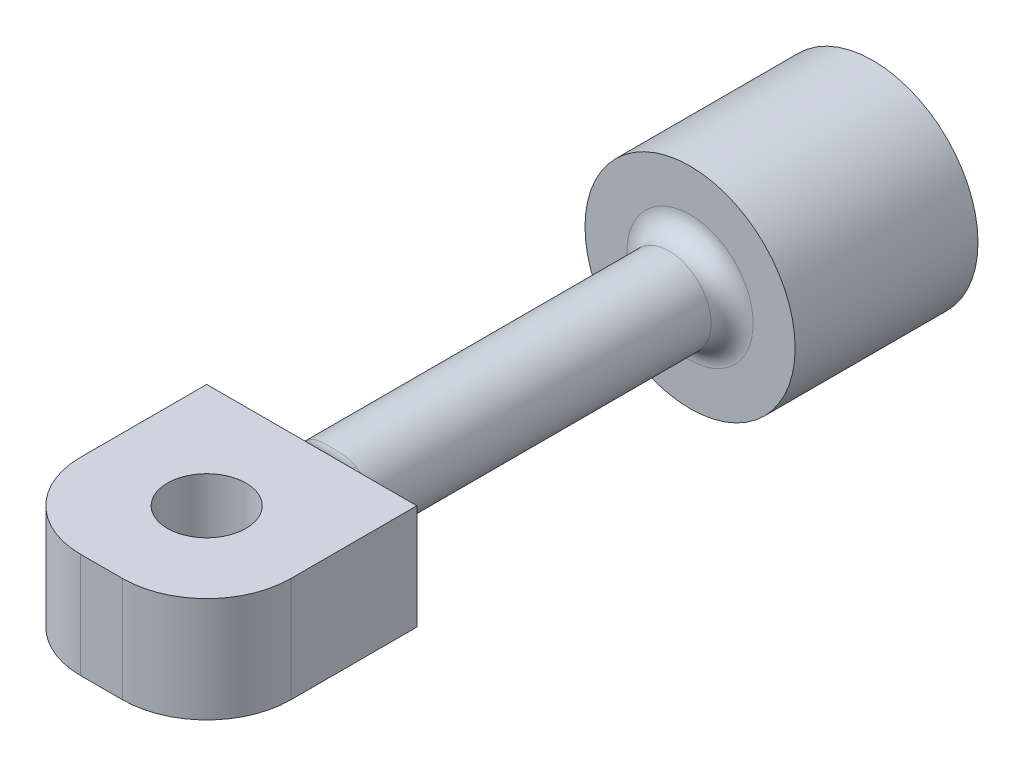
ISO-10303-21;
HEADER;
FILE_DESCRIPTION(('STEP AP214'),'2;1');
FILE_NAME('part.step','',(''),(''),'','','');
FILE_SCHEMA(('AUTOMOTIVE_DESIGN { 1 0 10303 214 1 1 1 1 }'));
ENDSEC;
DATA;
#1=APPLICATION_CONTEXT('core data for automotive mechanical design processes');
#2=APPLICATION_PROTOCOL_DEFINITION('international standard','automotive_design',2000,#1);
#3=PRODUCT_CONTEXT('',#1,'mechanical');
#4=PRODUCT('Part','Part','',(#3));
#5=PRODUCT_RELATED_PRODUCT_CATEGORY('part','',(#4));
#6=PRODUCT_DEFINITION_FORMATION('','',#4);
#7=PRODUCT_DEFINITION_CONTEXT('part definition',#1,'design');
#8=PRODUCT_DEFINITION('design','',#6,#7);
#9=PRODUCT_DEFINITION_SHAPE('','',#8);
#10=(LENGTH_UNIT() NAMED_UNIT(*) SI_UNIT(.MILLI.,.METRE.));
#11=(NAMED_UNIT(*) PLANE_ANGLE_UNIT() SI_UNIT($,.RADIAN.));
#12=(NAMED_UNIT(*) SI_UNIT($,.STERADIAN.) SOLID_ANGLE_UNIT());
#13=UNCERTAINTY_MEASURE_WITH_UNIT(LENGTH_MEASURE(1.E-05),#10,'distance_accuracy_value','');
#14=(GEOMETRIC_REPRESENTATION_CONTEXT(3) GLOBAL_UNCERTAINTY_ASSIGNED_CONTEXT((#13)) GLOBAL_UNIT_ASSIGNED_CONTEXT((#10,
#11,#12)) REPRESENTATION_CONTEXT('',''));
#15=CARTESIAN_POINT('',(0.,0.,0.));
#16=DIRECTION('',(0.,0.,1.));
#17=DIRECTION('',(1.,0.,0.));
#18=AXIS2_PLACEMENT_3D('',#15,#16,#17);
#19=CARTESIAN_POINT('',(0.,0.,33.909));
#20=DIRECTION('',(0.,0.,-1.));
#21=DIRECTION('',(-1.,0.,0.));
#22=AXIS2_PLACEMENT_3D('',#19,#20,#21);
#23=PLANE('',#22);
#24=DIRECTION('',(-1.,0.,0.));
#25=VECTOR('',#24,1.);
#26=CARTESIAN_POINT('',(-6.35,3.175,33.909));
#27=LINE('',#26,#25);
#28=CARTESIAN_POINT('',(-2.10605674187568,3.175,33.909));
#29=VERTEX_POINT('',#28);
#30=CARTESIAN_POINT('',(-6.35,3.175,33.909));
#31=VERTEX_POINT('',#30);
#32=EDGE_CURVE('E139',#29,#31,#27,.T.);
#33=ORIENTED_EDGE('',*,*,#32,.F.);
#34=CARTESIAN_POINT('',(0.,0.,33.909));
#35=DIRECTION('',(0.,0.,-1.));
#36=DIRECTION('',(-1.,0.,0.));
#37=AXIS2_PLACEMENT_3D('',#34,#35,#36);
#38=CIRCLE('',#37,3.81);
#39=CARTESIAN_POINT('',(-2.10605674187568,-3.175,33.909));
#40=VERTEX_POINT('',#39);
#41=EDGE_CURVE('E189',#29,#40,#38,.F.);
#42=ORIENTED_EDGE('',*,*,#41,.T.);
#43=DIRECTION('',(1.,0.,0.));
#44=VECTOR('',#43,1.);
#45=CARTESIAN_POINT('',(-6.35,-3.175,33.909));
#46=LINE('',#45,#44);
#47=CARTESIAN_POINT('',(-6.35,-3.175,33.909));
#48=VERTEX_POINT('',#47);
#49=EDGE_CURVE('E156',#48,#40,#46,.T.);
#50=ORIENTED_EDGE('',*,*,#49,.F.);
#51=DIRECTION('',(0.,-1.,0.));
#52=VECTOR('',#51,1.);
#53=CARTESIAN_POINT('',(-6.35,-3.175,33.909));
#54=LINE('',#53,#52);
#55=EDGE_CURVE('E136',#31,#48,#54,.T.);
#56=ORIENTED_EDGE('',*,*,#55,.F.);
#57=EDGE_LOOP('',(#33,#42,#50,#56));
#58=FACE_BOUND('',#57,.T.);
#59=ADVANCED_FACE('F38',(#58),#23,.T.);
#60=CARTESIAN_POINT('',(0.,0.,11.049));
#61=DIRECTION('',(0.,0.,-1.));
#62=DIRECTION('',(-1.,0.,0.));
#63=AXIS2_PLACEMENT_3D('',#60,#61,#62);
#64=CYLINDRICAL_SURFACE('',#63,6.35);
#65=CARTESIAN_POINT('',(0.,0.,11.049));
#66=DIRECTION('',(0.,0.,1.));
#67=DIRECTION('',(1.,0.,0.));
#68=AXIS2_PLACEMENT_3D('',#65,#66,#67);
#69=CIRCLE('',#68,6.35);
#70=CARTESIAN_POINT('',(6.35,0.,11.049));
#71=VERTEX_POINT('',#70);
#72=EDGE_CURVE('E166',#71,#71,#69,.T.);
#73=ORIENTED_EDGE('',*,*,#72,.F.);
#74=EDGE_LOOP('',(#73));
#75=FACE_BOUND('',#74,.T.);
#76=CARTESIAN_POINT('',(0.,0.,0.));
#77=DIRECTION('',(0.,0.,1.));
#78=DIRECTION('',(1.,0.,0.));
#79=AXIS2_PLACEMENT_3D('',#76,#77,#78);
#80=CIRCLE('',#79,6.35);
#81=CARTESIAN_POINT('',(6.35,0.,0.));
#82=VERTEX_POINT('',#81);
#83=EDGE_CURVE('E127',#82,#82,#80,.T.);
#84=ORIENTED_EDGE('',*,*,#83,.T.);
#85=EDGE_LOOP('',(#84));
#86=FACE_BOUND('',#85,.T.);
#87=ADVANCED_FACE('F283',(#75,#86),#64,.T.);
#88=CARTESIAN_POINT('',(0.,0.,11.049));
#89=DIRECTION('',(0.,0.,1.));
#90=DIRECTION('',(1.,0.,0.));
#91=AXIS2_PLACEMENT_3D('',#88,#89,#90);
#92=PLANE('',#91);
#93=CARTESIAN_POINT('',(0.,0.,11.049));
#94=DIRECTION('',(0.,0.,1.));
#95=DIRECTION('',(1.,0.,0.));
#96=AXIS2_PLACEMENT_3D('',#93,#94,#95);
#97=CIRCLE('',#96,3.81);
#98=CARTESIAN_POINT('',(3.81,0.,11.049));
#99=VERTEX_POINT('',#98);
#100=EDGE_CURVE('E11',#99,#99,#97,.F.);
#101=ORIENTED_EDGE('',*,*,#100,.T.);
#102=EDGE_LOOP('',(#101));
#103=FACE_BOUND('',#102,.T.);
#104=ORIENTED_EDGE('',*,*,#72,.T.);
#105=EDGE_LOOP('',(#104));
#106=FACE_BOUND('',#105,.T.);
#107=ADVANCED_FACE('F288',(#103,#106),#92,.T.);
#108=CARTESIAN_POINT('',(0.,0.,0.));
#109=DIRECTION('',(0.,0.,1.));
#110=DIRECTION('',(1.,0.,0.));
#111=AXIS2_PLACEMENT_3D('',#108,#109,#110);
#112=PLANE('',#111);
#113=ORIENTED_EDGE('',*,*,#83,.F.);
#114=EDGE_LOOP('',(#113));
#115=FACE_BOUND('',#114,.T.);
#116=ADVANCED_FACE('F281',(#115),#112,.F.);
#117=CARTESIAN_POINT('',(0.,0.,33.909));
#118=DIRECTION('',(0.,0.,-1.));
#119=DIRECTION('',(-1.,0.,0.));
#120=AXIS2_PLACEMENT_3D('',#117,#118,#119);
#121=CYLINDRICAL_SURFACE('',#120,2.54);
#122=CARTESIAN_POINT('',(2.75747346033165,3.175,33.909));
#123=CARTESIAN_POINT('',(1.45075360666102,2.15924582636556,34.3925103205279));
#124=CARTESIAN_POINT('',(1.8383156402211,1.75276798433748,32.762287335359));
#125=CARTESIAN_POINT('',(2.72145797705879,3.175,33.909));
#126=CARTESIAN_POINT('',(1.4619449534235,2.1364571380609,34.3627104337745));
#127=CARTESIAN_POINT('',(1.81430531803398,1.77796123271911,32.7443061096109));
#128=CARTESIAN_POINT('',(2.68412922378728,3.175,33.909));
#129=CARTESIAN_POINT('',(1.47073248027829,2.11840312635964,34.3306632550964));
#130=CARTESIAN_POINT('',(1.78941948251894,1.80301384779414,32.7287001018676));
#131=CARTESIAN_POINT('',(2.60721213015224,3.175,33.909));
#132=CARTESIAN_POINT('',(1.48263257214973,2.09138260314045,34.2651764844754));
#133=CARTESIAN_POINT('',(1.73814142009749,1.85249078486686,32.7017579648089));
#134=CARTESIAN_POINT('',(2.56762839040957,3.175,33.909));
#135=CARTESIAN_POINT('',(1.48588018624446,2.08220364788548,34.231802792635));
#136=CARTESIAN_POINT('',(1.71175226027164,1.87691624833565,32.6904134767656));
#137=CARTESIAN_POINT('',(2.44674360913777,3.175,33.909));
#138=CARTESIAN_POINT('',(1.48674334836591,2.06657196841838,34.1346097553019));
#139=CARTESIAN_POINT('',(1.63116240609462,1.94833753668744,32.6621789642376));
#140=CARTESIAN_POINT('',(2.3624790921311,3.175,33.909));
#141=CARTESIAN_POINT('',(1.47653785253469,2.07020606843899,34.0706978369796));
#142=CARTESIAN_POINT('',(1.57498606142162,1.99406237736209,32.6507044916589));
#143=CARTESIAN_POINT('',(2.1410703829851,3.175,33.909));
#144=CARTESIAN_POINT('',(1.42414088680289,2.10221098403041,33.9257559973822));
#145=CARTESIAN_POINT('',(1.42738025532204,2.10395038816791,32.6351701860049));
#146=CARTESIAN_POINT('',(1.99982997151836,3.175,33.909));
#147=CARTESIAN_POINT('',(1.36923366618578,2.14127021575293,33.8496502471815));
#148=CARTESIAN_POINT('',(1.33321998101189,2.16482858767716,32.6384013643611));
#149=CARTESIAN_POINT('',(1.70667074867858,3.175,33.909));
#150=CARTESIAN_POINT('',(1.22391730797736,2.22907432847525,33.7301349698206));
#151=CARTESIAN_POINT('',(1.13778049911941,2.27370249296661,32.6583169592671));
#152=CARTESIAN_POINT('',(1.55468546483664,3.175,33.909));
#153=CARTESIAN_POINT('',(1.13434514523384,2.27783580065136,33.684666092897));
#154=CARTESIAN_POINT('',(1.0364569765578,2.32160717117294,32.6750933064768));
#155=CARTESIAN_POINT('',(1.23295718880419,3.175,33.909));
#156=CARTESIAN_POINT('',(0.926866541861878,2.37010033517938,33.6155588797758));
#157=CARTESIAN_POINT('',(0.821971459202746,2.40625619806118,32.7136356489396));
#158=CARTESIAN_POINT('',(1.06270036998937,3.175,33.909));
#159=CARTESIAN_POINT('',(0.806864110490198,2.41413776676252,33.5919187450191));
#160=CARTESIAN_POINT('',(0.708466913326457,2.44208870148717,32.7356524902216));
#161=CARTESIAN_POINT('',(0.802850613272052,3.175,33.909));
#162=CARTESIAN_POINT('',(0.615600478159448,2.46650168060619,33.5681089924189));
#163=CARTESIAN_POINT('',(0.535233742181263,2.48367535672255,32.7642961639842));
#164=CARTESIAN_POINT('',(0.715600296142354,3.175,33.909));
#165=CARTESIAN_POINT('',(0.550403207057633,2.48168354496009,33.5620685227564));
#166=CARTESIAN_POINT('',(0.477066864094577,2.49550343318059,32.7731056136815));
#167=CARTESIAN_POINT('',(0.539873346842566,3.175,33.909));
#168=CARTESIAN_POINT('',(0.417599545586189,2.50699110839662,33.5527188341097));
#169=CARTESIAN_POINT('',(0.359915564561384,2.51507142565873,32.7882674505011));
#170=CARTESIAN_POINT('',(0.451397155316291,3.175,33.909));
#171=CARTESIAN_POINT('',(0.34977097576357,2.51721062537906,33.5493668970072));
#172=CARTESIAN_POINT('',(0.300931436877421,2.52281277344814,32.7946206979351));
#173=CARTESIAN_POINT('',(0.257633820372502,3.175,33.909));
#174=CARTESIAN_POINT('',(0.20052219015659,2.53350557205262,33.5442223062246));
#175=CARTESIAN_POINT('',(0.171755880248457,2.53515927163514,32.8049249501876));
#176=CARTESIAN_POINT('',(0.152191542896029,3.175,33.909));
#177=CARTESIAN_POINT('',(0.118388680708993,2.53859571542163,33.5427881251985));
#178=CARTESIAN_POINT('',(0.101461028597438,2.53894743153238,32.808236395569));
#179=CARTESIAN_POINT('',(-0.0588439476512452,3.175,33.909));
#180=CARTESIAN_POINT('',(-0.0457236454247866,2.54089515488794,33.5421241175975));
#181=CARTESIAN_POINT('',(-0.0392292984342492,2.54067137423043,32.8097290540229));
#182=CARTESIAN_POINT('',(-0.164437172904387,3.175,33.909));
#183=CARTESIAN_POINT('',(-0.128144441372206,2.53811621016374,33.5428909457727));
#184=CARTESIAN_POINT('',(-0.109624781936479,2.53860665450393,32.8079098265766));
#185=CARTESIAN_POINT('',(-0.375134437884289,3.175,33.909));
#186=CARTESIAN_POINT('',(-0.291191200794401,2.52489593997202,33.5469030657575));
#187=CARTESIAN_POINT('',(-0.250089625255972,2.52864167150419,32.7994527065369));
#188=CARTESIAN_POINT('',(-0.480235902219539,3.175,33.909));
#189=CARTESIAN_POINT('',(-0.372241171557344,2.51435942355359,33.5501784384892));
#190=CARTESIAN_POINT('',(-0.320157268145559,2.52072311386589,32.7927997086069));
#191=CARTESIAN_POINT('',(-0.688772361635576,3.175,33.909));
#192=CARTESIAN_POINT('',(-0.530475009564656,2.48633248453244,33.5602337205924));
#193=CARTESIAN_POINT('',(-0.459181574423796,2.49914052659052,32.7758264506634));
#194=CARTESIAN_POINT('',(-0.792207253663055,3.175,33.909));
#195=CARTESIAN_POINT('',(-0.608039298474719,2.468697060834,33.5670759119238));
#196=CARTESIAN_POINT('',(-0.528138169110239,2.48547614306246,32.7655059647719));
#197=CARTESIAN_POINT('',(-1.08102047728346,3.175,33.909));
#198=CARTESIAN_POINT('',(-0.820428628133336,2.41018525109081,33.5937840228559));
#199=CARTESIAN_POINT('',(-0.720680318186171,2.43897203089037,32.7335645468445));
#200=CARTESIAN_POINT('',(-1.26383869884293,3.175,33.909));
#201=CARTESIAN_POINT('',(-0.948845354349257,2.36181615097928,33.6200650298272));
#202=CARTESIAN_POINT('',(-0.842559132546411,2.39960403191938,32.7096298567921));
#203=CARTESIAN_POINT('',(-1.61836923396855,3.175,33.909));
#204=CARTESIAN_POINT('',(-1.17397398571186,2.25823492815116,33.7015655950387));
#205=CARTESIAN_POINT('',(-1.07891282266116,2.3029852734753,32.6678481808692));
#206=CARTESIAN_POINT('',(-1.79013250310725,3.175,33.909));
#207=CARTESIAN_POINT('',(-1.27118984233523,2.20186556768394,33.7587127825564));
#208=CARTESIAN_POINT('',(-1.19342166879709,2.24582490508662,32.6499713570588));
#209=CARTESIAN_POINT('',(-2.0566142211182,3.175,33.909));
#210=CARTESIAN_POINT('',(-1.38914589027986,2.12717702306518,33.8803251554777));
#211=CARTESIAN_POINT('',(-1.37107614737573,2.13962315517979,32.6380108959743));
#212=CARTESIAN_POINT('',(-2.15568332115343,3.175,33.909));
#213=CARTESIAN_POINT('',(-1.42513559033852,2.10219868982999,33.9356213641979));
#214=CARTESIAN_POINT('',(-1.43712221399043,2.09583194074454,32.6374439142818));
#215=CARTESIAN_POINT('',(-2.29937534719872,3.175,33.909));
#216=CARTESIAN_POINT('',(-1.46182244061619,2.07900024101459,34.0274930819406));
#217=CARTESIAN_POINT('',(-1.53291689806266,2.02567263231361,32.6458611282743));
#218=CARTESIAN_POINT('',(-2.34662112284787,3.175,33.909));
#219=CARTESIAN_POINT('',(-1.47119060673998,2.07367961547336,34.0604137288786));
#220=CARTESIAN_POINT('',(-1.56441408186909,2.00144186745873,32.6502454036791));
#221=CARTESIAN_POINT('',(-2.43913130996258,3.175,33.909));
#222=CARTESIAN_POINT('',(-1.48366955631215,2.06969009583306,34.1286792504366));
#223=CARTESIAN_POINT('',(-1.62608753999992,1.95167075755933,32.6627751978397));
#224=CARTESIAN_POINT('',(-2.48439247491016,3.175,33.909));
#225=CARTESIAN_POINT('',(-1.48661398449224,2.07119839725305,34.1640913822208));
#226=CARTESIAN_POINT('',(-1.65626164997896,1.92612840501469,32.6709266449294));
#227=CARTESIAN_POINT('',(-2.52848744698442,3.175,33.909));
#228=CARTESIAN_POINT('',(-1.48616480332682,2.07702560245629,34.1995970549083));
#229=CARTESIAN_POINT('',(-1.68565829798961,1.90004107913981,32.6812724046579));
#230=(BOUNDED_SURFACE() B_SPLINE_SURFACE(3,2,((#122,#123,#124),(#125,#126,#127),(#128,#129,
#130),(#131,#132,#133),(#134,#135,#136),(#137,#138,#139),(#140,#141,#142),(#143,#144,#145),
(#146,#147,#148),(#149,#150,#151),(#152,#153,#154),(#155,#156,#157),(#158,#159,#160),(#161,#162,
#163),(#164,#165,#166),(#167,#168,#169),(#170,#171,#172),(#173,#174,#175),(#176,#177,#178),
(#179,#180,#181),(#182,#183,#184),(#185,#186,#187),(#188,#189,#190),(#191,#192,#193),(#194,#195,
#196),(#197,#198,#199),(#200,#201,#202),(#203,#204,#205),(#206,#207,#208),(#209,#210,#211),
(#212,#213,#214),(#215,#216,#217),(#218,#219,#220),(#221,#222,#223),(#224,#225,#226),(#227,#228,
#229)),.UNSPECIFIED.,.F.,.F.,.F.) B_SPLINE_SURFACE_WITH_KNOTS((4,2,2,2,2,2,2,2,2,2,2,2,2,2,2,2,
2,4),(3,3),(0.,0.165478964280865,0.330631634870746,0.657187123329499,1.15911064900215,
1.66446964051091,2.20221153747686,2.47042166305056,2.73853775979549,3.05498965599523,
3.37146872352753,3.68894105243304,4.00643293763199,4.58500515335889,5.16068472701099,
5.51628394310174,5.69542592105601,5.87485077670779),(0.,1.),
.UNSPECIFIED.) GEOMETRIC_REPRESENTATION_ITEM() RATIONAL_B_SPLINE_SURFACE(((1.,0.593046572981363,
1.),(1.,0.599903529057048,1.),(1.,0.606980350720252,1.),(1.,0.621392399509858,1.),(1.,
0.628727089593793,1.),(1.,0.650721583165667,1.),(1.,0.665534782996795,1.),(1.,0.702309478093336,
1.),(1.,0.723837732724251,1.),(1.,0.763359635592699,1.),(1.,0.781328082295264,1.),(1.,
0.81353929178972,1.),(1.,0.827469535836317,1.),(1.,0.84375223507824,1.),(1.,0.848408111753961,
1.),(1.,0.856131724328274,1.),(1.,0.859200016423386,1.),(1.,0.864098930789858,1.),(1.,
0.865606705247396,1.),(1.,0.866292473729694,1.),(1.,0.865470267702701,1.),(1.,0.861511666313443,
1.),(1.,0.858368016026511,1.),(1.,0.849840328339414,1.),(1.,0.844456152943346,1.),(1.,
0.826251623547143,1.),(1.,0.810957187187147,1.),(1.,0.774307157851412,1.),(1.,0.752982250667473,
1.),(1.,0.715018996161015,1.),(1.,0.699705643124637,1.),(1.,0.676076182482073,1.),(1.,
0.668058615733603,1.),(1.,0.651959945216799,1.),(1.,0.643878761110568,1.),(1.,0.635848556141678,1.))) REPRESENTATION_ITEM('') SURFACE());
#231=CARTESIAN_POINT('',(-1.68565829798961,1.90004107913981,32.6812724046579));
#232=CARTESIAN_POINT('',(-1.65626164997896,1.92612840501469,32.6709266449294));
#233=CARTESIAN_POINT('',(-1.62608753999992,1.95167075755933,32.6627751978397));
#234=CARTESIAN_POINT('',(-1.56441408186909,2.00144186745873,32.6502454036791));
#235=CARTESIAN_POINT('',(-1.53291689806266,2.02567263231361,32.6458611282743));
#236=CARTESIAN_POINT('',(-1.43712221399043,2.09583194074454,32.6374439142818));
#237=CARTESIAN_POINT('',(-1.37107614737573,2.13962315517979,32.6380108959743));
#238=CARTESIAN_POINT('',(-1.19342166879709,2.24582490508662,32.6499713570588));
#239=CARTESIAN_POINT('',(-1.07891282266116,2.3029852734753,32.6678481808692));
#240=CARTESIAN_POINT('',(-0.842559132546411,2.39960403191938,32.7096298567921));
#241=CARTESIAN_POINT('',(-0.720680318186171,2.43897203089037,32.7335645468445));
#242=CARTESIAN_POINT('',(-0.528138169110239,2.48547614306246,32.7655059647719));
#243=CARTESIAN_POINT('',(-0.459181574423796,2.49914052659052,32.7758264506634));
#244=CARTESIAN_POINT('',(-0.320157268145559,2.52072311386589,32.7927997086069));
#245=CARTESIAN_POINT('',(-0.250089625255972,2.52864167150419,32.7994527065369));
#246=CARTESIAN_POINT('',(-0.109624781936479,2.53860665450393,32.8079098265766));
#247=CARTESIAN_POINT('',(-0.0392292984342491,2.54067137423043,32.8097290540229));
#248=CARTESIAN_POINT('',(0.101461028597438,2.53894743153238,32.808236395569));
#249=CARTESIAN_POINT('',(0.171755880248457,2.53515927163514,32.8049249501876));
#250=CARTESIAN_POINT('',(0.300931436877421,2.52281277344814,32.7946206979351));
#251=CARTESIAN_POINT('',(0.359915564561384,2.51507142565873,32.7882674505011));
#252=CARTESIAN_POINT('',(0.477066864094577,2.49550343318059,32.7731056136815));
#253=CARTESIAN_POINT('',(0.535233742181263,2.48367535672255,32.7642961639842));
#254=CARTESIAN_POINT('',(0.708466913326457,2.44208870148717,32.7356524902216));
#255=CARTESIAN_POINT('',(0.821971459202746,2.40625619806118,32.7136356489396));
#256=CARTESIAN_POINT('',(1.0364569765578,2.32160717117294,32.6750933064768));
#257=CARTESIAN_POINT('',(1.13778049911941,2.27370249296661,32.6583169592671));
#258=CARTESIAN_POINT('',(1.33321998101189,2.16482858767716,32.6384013643611));
#259=CARTESIAN_POINT('',(1.42738025532204,2.10395038816791,32.6351701860049));
#260=CARTESIAN_POINT('',(1.57498606142162,1.99406237736209,32.6507044916589));
#261=CARTESIAN_POINT('',(1.63116240609462,1.94833753668744,32.6621789642376));
#262=CARTESIAN_POINT('',(1.71175226027164,1.87691624833565,32.6904134767656));
#263=CARTESIAN_POINT('',(1.73814142009749,1.85249078486686,32.7017579648089));
#264=CARTESIAN_POINT('',(1.78941948251894,1.80301384779414,32.7287001018676));
#265=CARTESIAN_POINT('',(1.81430531803398,1.7779612327191,32.7443061096109));
#266=CARTESIAN_POINT('',(1.8383156402211,1.75276798433748,32.762287335359));
#267=B_SPLINE_CURVE_WITH_KNOTS('',3,(#231,#232,#233,#234,#235,#236,#237,#238,#239,#240,#241,
#242,#243,#244,#245,#246,#247,#248,#249,#250,#251,#252,#253,#254,#255,#256,#257,#258,#259,#260,
#261,#262,#263,#264,#265,#266),.UNSPECIFIED.,.F.,.F.,(4,2,2,2,2,2,2,2,2,2,2,2,2,2,2,2,2,4),(0.,
0.17942485565178,0.358566833606047,0.714166049696798,1.2898456233489,1.86841783907579,
2.18590972427475,2.50338205318026,2.81986112071256,3.13631301691229,3.40442911365723,
3.67263923923093,4.21038113619688,4.71574012770563,5.21766365337829,5.54421914183704,
5.70937181242692,5.87485077670779),.UNSPECIFIED.);
#268=CARTESIAN_POINT('',(-1.40403782791712,2.11666666666667,32.639));
#269=VERTEX_POINT('',#268);
#270=CARTESIAN_POINT('',(1.40403782791712,2.11666666666667,32.639));
#271=VERTEX_POINT('',#270);
#272=EDGE_CURVE('E194',#269,#271,#267,.T.);
#273=ORIENTED_EDGE('',*,*,#272,.T.);
#274=CARTESIAN_POINT('',(0.,0.,32.639));
#275=DIRECTION('',(0.,0.,-1.));
#276=DIRECTION('',(-1.,0.,0.));
#277=AXIS2_PLACEMENT_3D('',#274,#275,#276);
#278=CIRCLE('',#277,2.54);
#279=CARTESIAN_POINT('',(1.40403782791712,-2.11666666666667,32.639));
#280=VERTEX_POINT('',#279);
#281=EDGE_CURVE('E47',#271,#280,#278,.T.);
#282=ORIENTED_EDGE('',*,*,#281,.T.);
#283=CARTESIAN_POINT('',(-2.75747346033165,-3.175,33.909));
#284=CARTESIAN_POINT('',(-1.45075360666102,-2.15924582636556,34.3925103205279));
#285=CARTESIAN_POINT('',(-1.8383156402211,-1.75276798433748,32.762287335359));
#286=CARTESIAN_POINT('',(-2.72145797705879,-3.175,33.909));
#287=CARTESIAN_POINT('',(-1.4619449534235,-2.1364571380609,34.3627104337745));
#288=CARTESIAN_POINT('',(-1.81430531803398,-1.77796123271911,32.7443061096109));
#289=CARTESIAN_POINT('',(-2.68412922378728,-3.175,33.909));
#290=CARTESIAN_POINT('',(-1.47073248027829,-2.11840312635964,34.3306632550964));
#291=CARTESIAN_POINT('',(-1.78941948251894,-1.80301384779414,32.7287001018676));
#292=CARTESIAN_POINT('',(-2.60721213015224,-3.175,33.909));
#293=CARTESIAN_POINT('',(-1.48263257214973,-2.09138260314045,34.2651764844754));
#294=CARTESIAN_POINT('',(-1.73814142009749,-1.85249078486686,32.7017579648089));
#295=CARTESIAN_POINT('',(-2.56762839040957,-3.175,33.909));
#296=CARTESIAN_POINT('',(-1.48588018624446,-2.08220364788548,34.231802792635));
#297=CARTESIAN_POINT('',(-1.71175226027164,-1.87691624833565,32.6904134767656));
#298=CARTESIAN_POINT('',(-2.44674360913777,-3.175,33.909));
#299=CARTESIAN_POINT('',(-1.48674334836591,-2.06657196841838,34.1346097553019));
#300=CARTESIAN_POINT('',(-1.63116240609462,-1.94833753668744,32.6621789642376));
#301=CARTESIAN_POINT('',(-2.3624790921311,-3.175,33.909));
#302=CARTESIAN_POINT('',(-1.47653785253469,-2.07020606843899,34.0706978369796));
#303=CARTESIAN_POINT('',(-1.57498606142162,-1.99406237736209,32.6507044916589));
#304=CARTESIAN_POINT('',(-2.1410703829851,-3.175,33.909));
#305=CARTESIAN_POINT('',(-1.42414088680289,-2.10221098403041,33.9257559973822));
#306=CARTESIAN_POINT('',(-1.42738025532204,-2.10395038816791,32.6351701860049));
#307=CARTESIAN_POINT('',(-1.99982997151836,-3.175,33.909));
#308=CARTESIAN_POINT('',(-1.36923366618578,-2.14127021575293,33.8496502471815));
#309=CARTESIAN_POINT('',(-1.33321998101189,-2.16482858767716,32.6384013643611));
#310=CARTESIAN_POINT('',(-1.70667074867858,-3.175,33.909));
#311=CARTESIAN_POINT('',(-1.22391730797736,-2.22907432847525,33.7301349698206));
#312=CARTESIAN_POINT('',(-1.13778049911941,-2.27370249296661,32.6583169592671));
#313=CARTESIAN_POINT('',(-1.55468546483664,-3.175,33.909));
#314=CARTESIAN_POINT('',(-1.13434514523384,-2.27783580065136,33.684666092897));
#315=CARTESIAN_POINT('',(-1.0364569765578,-2.32160717117294,32.6750933064768));
#316=CARTESIAN_POINT('',(-1.23295718880419,-3.175,33.909));
#317=CARTESIAN_POINT('',(-0.926866541861878,-2.37010033517938,33.6155588797758));
#318=CARTESIAN_POINT('',(-0.821971459202746,-2.40625619806118,32.7136356489396));
#319=CARTESIAN_POINT('',(-1.06270036998937,-3.175,33.909));
#320=CARTESIAN_POINT('',(-0.806864110490198,-2.41413776676252,33.5919187450191));
#321=CARTESIAN_POINT('',(-0.708466913326457,-2.44208870148717,32.7356524902216));
#322=CARTESIAN_POINT('',(-0.802850613272052,-3.175,33.909));
#323=CARTESIAN_POINT('',(-0.615600478159448,-2.46650168060619,33.5681089924189));
#324=CARTESIAN_POINT('',(-0.535233742181263,-2.48367535672255,32.7642961639842));
#325=CARTESIAN_POINT('',(-0.715600296142354,-3.175,33.909));
#326=CARTESIAN_POINT('',(-0.550403207057633,-2.48168354496009,33.5620685227564));
#327=CARTESIAN_POINT('',(-0.477066864094577,-2.49550343318059,32.7731056136815));
#328=CARTESIAN_POINT('',(-0.539873346842566,-3.175,33.909));
#329=CARTESIAN_POINT('',(-0.417599545586189,-2.50699110839662,33.5527188341097));
#330=CARTESIAN_POINT('',(-0.359915564561384,-2.51507142565873,32.7882674505011));
#331=CARTESIAN_POINT('',(-0.451397155316291,-3.175,33.909));
#332=CARTESIAN_POINT('',(-0.34977097576357,-2.51721062537906,33.5493668970072));
#333=CARTESIAN_POINT('',(-0.300931436877421,-2.52281277344814,32.7946206979351));
#334=CARTESIAN_POINT('',(-0.257633820372502,-3.175,33.909));
#335=CARTESIAN_POINT('',(-0.20052219015659,-2.53350557205262,33.5442223062246));
#336=CARTESIAN_POINT('',(-0.171755880248457,-2.53515927163514,32.8049249501876));
#337=CARTESIAN_POINT('',(-0.152191542896029,-3.175,33.909));
#338=CARTESIAN_POINT('',(-0.118388680708993,-2.53859571542163,33.5427881251985));
#339=CARTESIAN_POINT('',(-0.101461028597438,-2.53894743153238,32.808236395569));
#340=CARTESIAN_POINT('',(0.0588439476512452,-3.175,33.909));
#341=CARTESIAN_POINT('',(0.0457236454247866,-2.54089515488794,33.5421241175975));
#342=CARTESIAN_POINT('',(0.0392292984342492,-2.54067137423043,32.8097290540229));
#343=CARTESIAN_POINT('',(0.164437172904387,-3.175,33.909));
#344=CARTESIAN_POINT('',(0.128144441372206,-2.53811621016374,33.5428909457727));
#345=CARTESIAN_POINT('',(0.109624781936479,-2.53860665450393,32.8079098265766));
#346=CARTESIAN_POINT('',(0.375134437884289,-3.175,33.909));
#347=CARTESIAN_POINT('',(0.291191200794401,-2.52489593997202,33.5469030657575));
#348=CARTESIAN_POINT('',(0.250089625255972,-2.52864167150419,32.7994527065369));
#349=CARTESIAN_POINT('',(0.480235902219539,-3.175,33.909));
#350=CARTESIAN_POINT('',(0.372241171557344,-2.51435942355359,33.5501784384892));
#351=CARTESIAN_POINT('',(0.320157268145559,-2.52072311386589,32.7927997086069));
#352=CARTESIAN_POINT('',(0.688772361635576,-3.175,33.909));
#353=CARTESIAN_POINT('',(0.530475009564656,-2.48633248453244,33.5602337205924));
#354=CARTESIAN_POINT('',(0.459181574423796,-2.49914052659052,32.7758264506634));
#355=CARTESIAN_POINT('',(0.792207253663055,-3.175,33.909));
#356=CARTESIAN_POINT('',(0.608039298474719,-2.468697060834,33.5670759119238));
#357=CARTESIAN_POINT('',(0.528138169110239,-2.48547614306246,32.7655059647719));
#358=CARTESIAN_POINT('',(1.08102047728346,-3.175,33.909));
#359=CARTESIAN_POINT('',(0.820428628133336,-2.41018525109081,33.5937840228559));
#360=CARTESIAN_POINT('',(0.720680318186171,-2.43897203089037,32.7335645468445));
#361=CARTESIAN_POINT('',(1.26383869884293,-3.175,33.909));
#362=CARTESIAN_POINT('',(0.948845354349257,-2.36181615097928,33.6200650298272));
#363=CARTESIAN_POINT('',(0.842559132546411,-2.39960403191938,32.7096298567921));
#364=CARTESIAN_POINT('',(1.61836923396855,-3.175,33.909));
#365=CARTESIAN_POINT('',(1.17397398571186,-2.25823492815116,33.7015655950387));
#366=CARTESIAN_POINT('',(1.07891282266116,-2.3029852734753,32.6678481808692));
#367=CARTESIAN_POINT('',(1.79013250310725,-3.175,33.909));
#368=CARTESIAN_POINT('',(1.27118984233523,-2.20186556768394,33.7587127825564));
#369=CARTESIAN_POINT('',(1.19342166879709,-2.24582490508662,32.6499713570588));
#370=CARTESIAN_POINT('',(2.0566142211182,-3.175,33.909));
#371=CARTESIAN_POINT('',(1.38914589027986,-2.12717702306518,33.8803251554777));
#372=CARTESIAN_POINT('',(1.37107614737573,-2.13962315517979,32.6380108959743));
#373=CARTESIAN_POINT('',(2.15568332115343,-3.175,33.909));
#374=CARTESIAN_POINT('',(1.42513559033852,-2.10219868982999,33.9356213641979));
#375=CARTESIAN_POINT('',(1.43712221399043,-2.09583194074454,32.6374439142818));
#376=CARTESIAN_POINT('',(2.29937534719872,-3.175,33.909));
#377=CARTESIAN_POINT('',(1.46182244061619,-2.07900024101459,34.0274930819406));
#378=CARTESIAN_POINT('',(1.53291689806266,-2.02567263231361,32.6458611282743));
#379=CARTESIAN_POINT('',(2.34662112284787,-3.175,33.909));
#380=CARTESIAN_POINT('',(1.47119060673998,-2.07367961547336,34.0604137288786));
#381=CARTESIAN_POINT('',(1.56441408186909,-2.00144186745873,32.6502454036791));
#382=CARTESIAN_POINT('',(2.43913130996258,-3.175,33.909));
#383=CARTESIAN_POINT('',(1.48366955631215,-2.06969009583306,34.1286792504366));
#384=CARTESIAN_POINT('',(1.62608753999992,-1.95167075755933,32.6627751978397));
#385=CARTESIAN_POINT('',(2.48439247491016,-3.175,33.909));
#386=CARTESIAN_POINT('',(1.48661398449224,-2.07119839725305,34.1640913822208));
#387=CARTESIAN_POINT('',(1.65626164997896,-1.92612840501469,32.6709266449294));
#388=CARTESIAN_POINT('',(2.52848744698442,-3.175,33.909));
#389=CARTESIAN_POINT('',(1.48616480332682,-2.07702560245629,34.1995970549083));
#390=CARTESIAN_POINT('',(1.68565829798961,-1.90004107913981,32.6812724046579));
#391=(BOUNDED_SURFACE() B_SPLINE_SURFACE(3,2,((#283,#284,#285),(#286,#287,#288),(#289,#290,
#291),(#292,#293,#294),(#295,#296,#297),(#298,#299,#300),(#301,#302,#303),(#304,#305,#306),
(#307,#308,#309),(#310,#311,#312),(#313,#314,#315),(#316,#317,#318),(#319,#320,#321),(#322,#323,
#324),(#325,#326,#327),(#328,#329,#330),(#331,#332,#333),(#334,#335,#336),(#337,#338,#339),
(#340,#341,#342),(#343,#344,#345),(#346,#347,#348),(#349,#350,#351),(#352,#353,#354),(#355,#356,
#357),(#358,#359,#360),(#361,#362,#363),(#364,#365,#366),(#367,#368,#369),(#370,#371,#372),
(#373,#374,#375),(#376,#377,#378),(#379,#380,#381),(#382,#383,#384),(#385,#386,#387),(#388,#389,
#390)),.UNSPECIFIED.,.F.,.F.,.F.) B_SPLINE_SURFACE_WITH_KNOTS((4,2,2,2,2,2,2,2,2,2,2,2,2,2,2,2,
2,4),(3,3),(0.,0.165478964280865,0.330631634870746,0.657187123329499,1.15911064900215,
1.66446964051091,2.20221153747686,2.47042166305056,2.73853775979549,3.05498965599523,
3.37146872352753,3.68894105243304,4.00643293763199,4.58500515335889,5.16068472701099,
5.51628394310174,5.69542592105601,5.87485077670779),(0.,1.),
.UNSPECIFIED.) GEOMETRIC_REPRESENTATION_ITEM() RATIONAL_B_SPLINE_SURFACE(((1.,0.593046572981363,
1.),(1.,0.599903529057048,1.),(1.,0.606980350720252,1.),(1.,0.621392399509858,1.),(1.,
0.628727089593793,1.),(1.,0.650721583165667,1.),(1.,0.665534782996795,1.),(1.,0.702309478093336,
1.),(1.,0.723837732724251,1.),(1.,0.763359635592699,1.),(1.,0.781328082295264,1.),(1.,
0.81353929178972,1.),(1.,0.827469535836317,1.),(1.,0.84375223507824,1.),(1.,0.848408111753961,
1.),(1.,0.856131724328274,1.),(1.,0.859200016423386,1.),(1.,0.864098930789858,1.),(1.,
0.865606705247396,1.),(1.,0.866292473729694,1.),(1.,0.865470267702701,1.),(1.,0.861511666313443,
1.),(1.,0.858368016026511,1.),(1.,0.849840328339414,1.),(1.,0.844456152943346,1.),(1.,
0.826251623547143,1.),(1.,0.810957187187147,1.),(1.,0.774307157851412,1.),(1.,0.752982250667473,
1.),(1.,0.715018996161015,1.),(1.,0.699705643124637,1.),(1.,0.676076182482073,1.),(1.,
0.668058615733603,1.),(1.,0.651959945216799,1.),(1.,0.643878761110568,1.),(1.,0.635848556141678,1.))) REPRESENTATION_ITEM('') SURFACE());
#392=CARTESIAN_POINT('',(1.68565829798961,-1.90004107913981,32.6812724046579));
#393=CARTESIAN_POINT('',(1.65626164997896,-1.92612840501469,32.6709266449294));
#394=CARTESIAN_POINT('',(1.62608753999992,-1.95167075755933,32.6627751978397));
#395=CARTESIAN_POINT('',(1.56441408186909,-2.00144186745873,32.6502454036791));
#396=CARTESIAN_POINT('',(1.53291689806266,-2.02567263231361,32.6458611282743));
#397=CARTESIAN_POINT('',(1.43712221399043,-2.09583194074454,32.6374439142818));
#398=CARTESIAN_POINT('',(1.37107614737573,-2.13962315517979,32.6380108959743));
#399=CARTESIAN_POINT('',(1.19342166879709,-2.24582490508662,32.6499713570588));
#400=CARTESIAN_POINT('',(1.07891282266116,-2.3029852734753,32.6678481808692));
#401=CARTESIAN_POINT('',(0.842559132546411,-2.39960403191938,32.7096298567921));
#402=CARTESIAN_POINT('',(0.720680318186171,-2.43897203089037,32.7335645468445));
#403=CARTESIAN_POINT('',(0.528138169110239,-2.48547614306246,32.7655059647719));
#404=CARTESIAN_POINT('',(0.459181574423796,-2.49914052659052,32.7758264506634));
#405=CARTESIAN_POINT('',(0.320157268145559,-2.52072311386589,32.7927997086069));
#406=CARTESIAN_POINT('',(0.250089625255972,-2.52864167150419,32.7994527065369));
#407=CARTESIAN_POINT('',(0.109624781936479,-2.53860665450393,32.8079098265766));
#408=CARTESIAN_POINT('',(0.0392292984342491,-2.54067137423043,32.8097290540229));
#409=CARTESIAN_POINT('',(-0.101461028597438,-2.53894743153238,32.808236395569));
#410=CARTESIAN_POINT('',(-0.171755880248457,-2.53515927163514,32.8049249501876));
#411=CARTESIAN_POINT('',(-0.300931436877421,-2.52281277344814,32.7946206979351));
#412=CARTESIAN_POINT('',(-0.359915564561384,-2.51507142565873,32.7882674505011));
#413=CARTESIAN_POINT('',(-0.477066864094577,-2.49550343318059,32.7731056136815));
#414=CARTESIAN_POINT('',(-0.535233742181263,-2.48367535672255,32.7642961639842));
#415=CARTESIAN_POINT('',(-0.708466913326457,-2.44208870148717,32.7356524902216));
#416=CARTESIAN_POINT('',(-0.821971459202746,-2.40625619806118,32.7136356489396));
#417=CARTESIAN_POINT('',(-1.0364569765578,-2.32160717117294,32.6750933064768));
#418=CARTESIAN_POINT('',(-1.13778049911941,-2.27370249296661,32.6583169592671));
#419=CARTESIAN_POINT('',(-1.33321998101189,-2.16482858767716,32.6384013643611));
#420=CARTESIAN_POINT('',(-1.42738025532204,-2.10395038816791,32.6351701860049));
#421=CARTESIAN_POINT('',(-1.57498606142162,-1.99406237736209,32.6507044916589));
#422=CARTESIAN_POINT('',(-1.63116240609462,-1.94833753668744,32.6621789642376));
#423=CARTESIAN_POINT('',(-1.71175226027164,-1.87691624833565,32.6904134767656));
#424=CARTESIAN_POINT('',(-1.73814142009749,-1.85249078486686,32.7017579648089));
#425=CARTESIAN_POINT('',(-1.78941948251894,-1.80301384779414,32.7287001018676));
#426=CARTESIAN_POINT('',(-1.81430531803398,-1.7779612327191,32.7443061096109));
#427=CARTESIAN_POINT('',(-1.8383156402211,-1.75276798433748,32.762287335359));
#428=B_SPLINE_CURVE_WITH_KNOTS('',3,(#392,#393,#394,#395,#396,#397,#398,#399,#400,#401,#402,
#403,#404,#405,#406,#407,#408,#409,#410,#411,#412,#413,#414,#415,#416,#417,#418,#419,#420,#421,
#422,#423,#424,#425,#426,#427),.UNSPECIFIED.,.F.,.F.,(4,2,2,2,2,2,2,2,2,2,2,2,2,2,2,2,2,4),(0.,
0.17942485565178,0.358566833606047,0.714166049696798,1.2898456233489,1.86841783907579,
2.18590972427475,2.50338205318026,2.81986112071256,3.13631301691229,3.40442911365723,
3.67263923923093,4.21038113619688,4.71574012770563,5.21766365337829,5.54421914183704,
5.70937181242692,5.87485077670779),.UNSPECIFIED.);
#429=CARTESIAN_POINT('',(-1.40403782791712,-2.11666666666667,32.639));
#430=VERTEX_POINT('',#429);
#431=EDGE_CURVE('E58',#280,#430,#428,.T.);
#432=ORIENTED_EDGE('',*,*,#431,.T.);
#433=CARTESIAN_POINT('',(0.,0.,32.639));
#434=DIRECTION('',(0.,0.,-1.));
#435=DIRECTION('',(-1.,0.,0.));
#436=AXIS2_PLACEMENT_3D('',#433,#434,#435);
#437=CIRCLE('',#436,2.54);
#438=EDGE_CURVE('E202',#430,#269,#437,.T.);
#439=ORIENTED_EDGE('',*,*,#438,.T.);
#440=EDGE_LOOP('',(#273,#282,#432,#439));
#441=FACE_BOUND('',#440,.T.);
#442=CARTESIAN_POINT('',(0.,0.,12.319));
#443=DIRECTION('',(0.,0.,1.));
#444=DIRECTION('',(1.,0.,0.));
#445=AXIS2_PLACEMENT_3D('',#442,#443,#444);
#446=CIRCLE('',#445,2.54);
#447=CARTESIAN_POINT('',(2.54,0.,12.319));
#448=VERTEX_POINT('',#447);
#449=EDGE_CURVE('E191',#448,#448,#446,.T.);
#450=ORIENTED_EDGE('',*,*,#449,.T.);
#451=EDGE_LOOP('',(#450));
#452=FACE_BOUND('',#451,.T.);
#453=ADVANCED_FACE('F204',(#441,#452),#121,.T.);
#454=CARTESIAN_POINT('',(6.35,-3.175,46.609));
#455=DIRECTION('',(-1.,0.,0.));
#456=DIRECTION('',(0.,0.,1.));
#457=AXIS2_PLACEMENT_3D('',#454,#455,#456);
#458=PLANE('',#457);
#459=DIRECTION('',(0.,0.,-1.));
#460=VECTOR('',#459,1.);
#461=CARTESIAN_POINT('',(6.35,3.175,46.609));
#462=LINE('',#461,#460);
#463=CARTESIAN_POINT('',(6.35,3.175,41.529));
#464=VERTEX_POINT('',#463);
#465=CARTESIAN_POINT('',(6.35,3.175,33.909));
#466=VERTEX_POINT('',#465);
#467=EDGE_CURVE('E115',#464,#466,#462,.T.);
#468=ORIENTED_EDGE('',*,*,#467,.F.);
#469=DIRECTION('',(0.,1.,0.));
#470=VECTOR('',#469,1.);
#471=CARTESIAN_POINT('',(6.35,-3.175,41.529));
#472=LINE('',#471,#470);
#473=CARTESIAN_POINT('',(6.35,-3.175,41.529));
#474=VERTEX_POINT('',#473);
#475=EDGE_CURVE('E186',#464,#474,#472,.F.);
#476=ORIENTED_EDGE('',*,*,#475,.T.);
#477=DIRECTION('',(0.,0.,-1.));
#478=VECTOR('',#477,1.);
#479=CARTESIAN_POINT('',(6.35,-3.175,46.609));
#480=LINE('',#479,#478);
#481=CARTESIAN_POINT('',(6.35,-3.175,33.909));
#482=VERTEX_POINT('',#481);
#483=EDGE_CURVE('E143',#474,#482,#480,.T.);
#484=ORIENTED_EDGE('',*,*,#483,.T.);
#485=DIRECTION('',(0.,1.,0.));
#486=VECTOR('',#485,1.);
#487=CARTESIAN_POINT('',(6.35,-3.175,33.909));
#488=LINE('',#487,#486);
#489=EDGE_CURVE('E133',#482,#466,#488,.T.);
#490=ORIENTED_EDGE('',*,*,#489,.T.);
#491=EDGE_LOOP('',(#468,#476,#484,#490));
#492=FACE_BOUND('',#491,.T.);
#493=ADVANCED_FACE('F141',(#492),#458,.F.);
#494=CARTESIAN_POINT('',(-6.35,3.175,46.609));
#495=DIRECTION('',(0.,-1.,0.));
#496=DIRECTION('',(0.,0.,-1.));
#497=AXIS2_PLACEMENT_3D('',#494,#495,#496);
#498=PLANE('',#497);
#499=CARTESIAN_POINT('',(0.,3.175,40.259));
#500=DIRECTION('',(0.,1.,0.));
#501=DIRECTION('',(0.,0.,1.));
#502=AXIS2_PLACEMENT_3D('',#499,#500,#501);
#503=CIRCLE('',#502,2.3749);
#504=CARTESIAN_POINT('',(0.,3.175,42.6339));
#505=VERTEX_POINT('',#504);
#506=EDGE_CURVE('E314',#505,#505,#503,.T.);
#507=ORIENTED_EDGE('',*,*,#506,.F.);
#508=EDGE_LOOP('',(#507));
#509=FACE_BOUND('',#508,.T.);
#510=DIRECTION('',(0.,0.,-1.));
#511=VECTOR('',#510,1.);
#512=CARTESIAN_POINT('',(-6.35,3.175,46.609));
#513=LINE('',#512,#511);
#514=CARTESIAN_POINT('',(-6.35,3.175,41.529));
#515=VERTEX_POINT('',#514);
#516=EDGE_CURVE('E128',#515,#31,#513,.T.);
#517=ORIENTED_EDGE('',*,*,#516,.F.);
#518=CARTESIAN_POINT('',(-1.27,3.175,41.529));
#519=DIRECTION('',(0.,-1.,0.));
#520=DIRECTION('',(0.,0.,-1.));
#521=AXIS2_PLACEMENT_3D('',#518,#519,#520);
#522=CIRCLE('',#521,5.08);
#523=CARTESIAN_POINT('',(-1.27,3.175,46.609));
#524=VERTEX_POINT('',#523);
#525=EDGE_CURVE('E184',#515,#524,#522,.F.);
#526=ORIENTED_EDGE('',*,*,#525,.T.);
#527=DIRECTION('',(-1.,0.,0.));
#528=VECTOR('',#527,1.);
#529=CARTESIAN_POINT('',(-6.35,3.175,46.609));
#530=LINE('',#529,#528);
#531=CARTESIAN_POINT('',(1.27,3.175,46.609));
#532=VERTEX_POINT('',#531);
#533=EDGE_CURVE('E159',#532,#524,#530,.T.);
#534=ORIENTED_EDGE('',*,*,#533,.F.);
#535=CARTESIAN_POINT('',(1.27,3.175,41.529));
#536=DIRECTION('',(0.,-1.,0.));
#537=DIRECTION('',(0.,0.,-1.));
#538=AXIS2_PLACEMENT_3D('',#535,#536,#537);
#539=CIRCLE('',#538,5.08);
#540=EDGE_CURVE('E123',#532,#464,#539,.F.);
#541=ORIENTED_EDGE('',*,*,#540,.T.);
#542=ORIENTED_EDGE('',*,*,#467,.T.);
#543=CARTESIAN_POINT('',(2.10605674187568,3.175,33.909));
#544=VERTEX_POINT('',#543);
#545=EDGE_CURVE('E120',#466,#544,#27,.T.);
#546=ORIENTED_EDGE('',*,*,#545,.T.);
#547=EDGE_CURVE('E137',#544,#29,#27,.T.);
#548=ORIENTED_EDGE('',*,*,#547,.T.);
#549=ORIENTED_EDGE('',*,*,#32,.T.);
#550=EDGE_LOOP('',(#517,#526,#534,#541,#542,#546,#548,#549));
#551=FACE_BOUND('',#550,.T.);
#552=ADVANCED_FACE('F118',(#509,#551),#498,.F.);
#553=CARTESIAN_POINT('',(-6.35,-3.175,46.609));
#554=DIRECTION('',(1.,0.,0.));
#555=DIRECTION('',(0.,0.,-1.));
#556=AXIS2_PLACEMENT_3D('',#553,#554,#555);
#557=PLANE('',#556);
#558=DIRECTION('',(0.,0.,-1.));
#559=VECTOR('',#558,1.);
#560=CARTESIAN_POINT('',(-6.35,-3.175,46.609));
#561=LINE('',#560,#559);
#562=CARTESIAN_POINT('',(-6.35,-3.175,41.529));
#563=VERTEX_POINT('',#562);
#564=EDGE_CURVE('E162',#563,#48,#561,.T.);
#565=ORIENTED_EDGE('',*,*,#564,.F.);
#566=DIRECTION('',(0.,-1.,0.));
#567=VECTOR('',#566,1.);
#568=CARTESIAN_POINT('',(-6.35,-3.175,41.529));
#569=LINE('',#568,#567);
#570=EDGE_CURVE('E181',#563,#515,#569,.F.);
#571=ORIENTED_EDGE('',*,*,#570,.T.);
#572=ORIENTED_EDGE('',*,*,#516,.T.);
#573=ORIENTED_EDGE('',*,*,#55,.T.);
#574=EDGE_LOOP('',(#565,#571,#572,#573));
#575=FACE_BOUND('',#574,.T.);
#576=ADVANCED_FACE('F270',(#575),#557,.F.);
#577=CARTESIAN_POINT('',(-6.35,-3.175,46.609));
#578=DIRECTION('',(0.,1.,0.));
#579=DIRECTION('',(0.,0.,1.));
#580=AXIS2_PLACEMENT_3D('',#577,#578,#579);
#581=PLANE('',#580);
#582=CARTESIAN_POINT('',(0.,-3.175,40.259));
#583=DIRECTION('',(0.,1.,0.));
#584=DIRECTION('',(0.,0.,1.));
#585=AXIS2_PLACEMENT_3D('',#582,#583,#584);
#586=CIRCLE('',#585,2.3749);
#587=CARTESIAN_POINT('',(0.,-3.175,42.6339));
#588=VERTEX_POINT('',#587);
#589=EDGE_CURVE('E42',#588,#588,#586,.T.);
#590=ORIENTED_EDGE('',*,*,#589,.T.);
#591=EDGE_LOOP('',(#590));
#592=FACE_BOUND('',#591,.T.);
#593=DIRECTION('',(1.,0.,0.));
#594=VECTOR('',#593,1.);
#595=CARTESIAN_POINT('',(-6.35,-3.175,46.609));
#596=LINE('',#595,#594);
#597=CARTESIAN_POINT('',(-1.27,-3.175,46.609));
#598=VERTEX_POINT('',#597);
#599=CARTESIAN_POINT('',(1.27,-3.175,46.609));
#600=VERTEX_POINT('',#599);
#601=EDGE_CURVE('E150',#598,#600,#596,.T.);
#602=ORIENTED_EDGE('',*,*,#601,.F.);
#603=CARTESIAN_POINT('',(-1.27,-3.175,41.529));
#604=DIRECTION('',(0.,1.,0.));
#605=DIRECTION('',(0.,0.,1.));
#606=AXIS2_PLACEMENT_3D('',#603,#604,#605);
#607=CIRCLE('',#606,5.08);
#608=EDGE_CURVE('E179',#598,#563,#607,.F.);
#609=ORIENTED_EDGE('',*,*,#608,.T.);
#610=ORIENTED_EDGE('',*,*,#564,.T.);
#611=ORIENTED_EDGE('',*,*,#49,.T.);
#612=CARTESIAN_POINT('',(2.10605674187568,-3.175,33.909));
#613=VERTEX_POINT('',#612);
#614=EDGE_CURVE('E160',#40,#613,#46,.T.);
#615=ORIENTED_EDGE('',*,*,#614,.T.);
#616=EDGE_CURVE('E155',#613,#482,#46,.T.);
#617=ORIENTED_EDGE('',*,*,#616,.T.);
#618=ORIENTED_EDGE('',*,*,#483,.F.);
#619=CARTESIAN_POINT('',(1.27,-3.175,41.529));
#620=DIRECTION('',(0.,1.,0.));
#621=DIRECTION('',(0.,0.,1.));
#622=AXIS2_PLACEMENT_3D('',#619,#620,#621);
#623=CIRCLE('',#622,5.08);
#624=EDGE_CURVE('E177',#474,#600,#623,.F.);
#625=ORIENTED_EDGE('',*,*,#624,.T.);
#626=EDGE_LOOP('',(#602,#609,#610,#611,#615,#617,#618,#625));
#627=FACE_BOUND('',#626,.T.);
#628=ADVANCED_FACE('F265',(#592,#627),#581,.F.);
#629=CARTESIAN_POINT('',(0.,0.,46.609));
#630=DIRECTION('',(0.,0.,-1.));
#631=DIRECTION('',(-1.,0.,0.));
#632=AXIS2_PLACEMENT_3D('',#629,#630,#631);
#633=PLANE('',#632);
#634=ORIENTED_EDGE('',*,*,#533,.T.);
#635=DIRECTION('',(0.,-1.,0.));
#636=VECTOR('',#635,1.);
#637=CARTESIAN_POINT('',(-1.27,0.,46.609));
#638=LINE('',#637,#636);
#639=EDGE_CURVE('E174',#524,#598,#638,.T.);
#640=ORIENTED_EDGE('',*,*,#639,.T.);
#641=ORIENTED_EDGE('',*,*,#601,.T.);
#642=DIRECTION('',(0.,1.,0.));
#643=VECTOR('',#642,1.);
#644=CARTESIAN_POINT('',(1.27,0.,46.609));
#645=LINE('',#644,#643);
#646=EDGE_CURVE('E169',#600,#532,#645,.T.);
#647=ORIENTED_EDGE('',*,*,#646,.T.);
#648=EDGE_LOOP('',(#634,#640,#641,#647));
#649=FACE_BOUND('',#648,.T.);
#650=ADVANCED_FACE('F269',(#649),#633,.F.);
#651=ORIENTED_EDGE('',*,*,#616,.F.);
#652=CARTESIAN_POINT('',(0.,0.,33.909));
#653=DIRECTION('',(0.,0.,-1.));
#654=DIRECTION('',(-1.,0.,0.));
#655=AXIS2_PLACEMENT_3D('',#652,#653,#654);
#656=CIRCLE('',#655,3.81);
#657=EDGE_CURVE('E135',#613,#544,#656,.F.);
#658=ORIENTED_EDGE('',*,*,#657,.T.);
#659=ORIENTED_EDGE('',*,*,#545,.F.);
#660=ORIENTED_EDGE('',*,*,#489,.F.);
#661=EDGE_LOOP('',(#651,#658,#659,#660));
#662=FACE_BOUND('',#661,.T.);
#663=ADVANCED_FACE('F132',(#662),#23,.T.);
#664=CARTESIAN_POINT('',(-1.27,0.,41.529));
#665=DIRECTION('',(0.,-1.,0.));
#666=DIRECTION('',(0.,0.,-1.));
#667=AXIS2_PLACEMENT_3D('',#664,#665,#666);
#668=CYLINDRICAL_SURFACE('',#667,5.08);
#669=ORIENTED_EDGE('',*,*,#525,.F.);
#670=ORIENTED_EDGE('',*,*,#570,.F.);
#671=ORIENTED_EDGE('',*,*,#608,.F.);
#672=ORIENTED_EDGE('',*,*,#639,.F.);
#673=EDGE_LOOP('',(#669,#670,#671,#672));
#674=FACE_BOUND('',#673,.T.);
#675=ADVANCED_FACE('F293',(#674),#668,.T.);
#676=CARTESIAN_POINT('',(1.27,0.,41.529));
#677=DIRECTION('',(0.,1.,0.));
#678=DIRECTION('',(0.,0.,1.));
#679=AXIS2_PLACEMENT_3D('',#676,#677,#678);
#680=CYLINDRICAL_SURFACE('',#679,5.08);
#681=ORIENTED_EDGE('',*,*,#624,.F.);
#682=ORIENTED_EDGE('',*,*,#475,.F.);
#683=ORIENTED_EDGE('',*,*,#540,.F.);
#684=ORIENTED_EDGE('',*,*,#646,.F.);
#685=EDGE_LOOP('',(#681,#682,#683,#684));
#686=FACE_BOUND('',#685,.T.);
#687=ADVANCED_FACE('F212',(#686),#680,.T.);
#688=CARTESIAN_POINT('',(-2.10605674187567,-3.17500000000001,32.639));
#689=DIRECTION('',(-0.833333333333335,0.552770798392564,0.));
#690=DIRECTION('',(-0.552770798392564,-0.833333333333335,0.));
#691=AXIS2_PLACEMENT_3D('',#688,#689,#690);
#692=CIRCLE('',#691,1.27);
#693=EDGE_CURVE('E147',#430,#40,#692,.F.);
#694=ORIENTED_EDGE('',*,*,#693,.F.);
#695=ORIENTED_EDGE('',*,*,#431,.F.);
#696=CARTESIAN_POINT('',(2.10605674187568,-3.175,32.639));
#697=DIRECTION('',(-0.833333333333333,-0.552770798392566,0.));
#698=DIRECTION('',(0.552770798392566,-0.833333333333334,0.));
#699=AXIS2_PLACEMENT_3D('',#696,#697,#698);
#700=CIRCLE('',#699,1.27);
#701=EDGE_CURVE('E144',#613,#280,#700,.T.);
#702=ORIENTED_EDGE('',*,*,#701,.F.);
#703=ORIENTED_EDGE('',*,*,#614,.F.);
#704=EDGE_LOOP('',(#694,#695,#702,#703));
#705=FACE_BOUND('',#704,.T.);
#706=ADVANCED_FACE('F245',(#705),#391,.F.);
#707=CARTESIAN_POINT('',(0.,0.,32.639));
#708=DIRECTION('',(0.,0.,-1.));
#709=DIRECTION('',(-1.,0.,0.));
#710=AXIS2_PLACEMENT_3D('',#707,#708,#709);
#711=TOROIDAL_SURFACE('',#710,3.81,1.27);
#712=ORIENTED_EDGE('',*,*,#701,.T.);
#713=ORIENTED_EDGE('',*,*,#281,.F.);
#714=CARTESIAN_POINT('',(2.10605674187568,3.175,32.639));
#715=DIRECTION('',(0.833333333333333,-0.552770798392567,0.));
#716=DIRECTION('',(0.552770798392567,0.833333333333333,0.));
#717=AXIS2_PLACEMENT_3D('',#714,#715,#716);
#718=CIRCLE('',#717,1.27);
#719=EDGE_CURVE('E318',#544,#271,#718,.T.);
#720=ORIENTED_EDGE('',*,*,#719,.F.);
#721=ORIENTED_EDGE('',*,*,#657,.F.);
#722=EDGE_LOOP('',(#712,#713,#720,#721));
#723=FACE_BOUND('',#722,.T.);
#724=ADVANCED_FACE('F242',(#723),#711,.F.);
#725=CARTESIAN_POINT('',(0.,0.,32.639));
#726=DIRECTION('',(0.,0.,-1.));
#727=DIRECTION('',(-1.,0.,0.));
#728=AXIS2_PLACEMENT_3D('',#725,#726,#727);
#729=TOROIDAL_SURFACE('',#728,3.81,1.27);
#730=ORIENTED_EDGE('',*,*,#693,.T.);
#731=ORIENTED_EDGE('',*,*,#41,.F.);
#732=CARTESIAN_POINT('',(-2.10605674187568,3.175,32.639));
#733=DIRECTION('',(-0.833333333333333,-0.552770798392567,0.));
#734=DIRECTION('',(0.552770798392567,-0.833333333333333,0.));
#735=AXIS2_PLACEMENT_3D('',#732,#733,#734);
#736=CIRCLE('',#735,1.27);
#737=EDGE_CURVE('E317',#269,#29,#736,.T.);
#738=ORIENTED_EDGE('',*,*,#737,.F.);
#739=ORIENTED_EDGE('',*,*,#438,.F.);
#740=EDGE_LOOP('',(#730,#731,#738,#739));
#741=FACE_BOUND('',#740,.T.);
#742=ADVANCED_FACE('F221',(#741),#729,.F.);
#743=ORIENTED_EDGE('',*,*,#719,.T.);
#744=ORIENTED_EDGE('',*,*,#272,.F.);
#745=ORIENTED_EDGE('',*,*,#737,.T.);
#746=ORIENTED_EDGE('',*,*,#547,.F.);
#747=EDGE_LOOP('',(#743,#744,#745,#746));
#748=FACE_BOUND('',#747,.T.);
#749=ADVANCED_FACE('F216',(#748),#230,.F.);
#750=CARTESIAN_POINT('',(0.,0.,12.319));
#751=DIRECTION('',(0.,0.,1.));
#752=DIRECTION('',(1.,0.,0.));
#753=AXIS2_PLACEMENT_3D('',#750,#751,#752);
#754=TOROIDAL_SURFACE('',#753,3.81,1.27);
#755=ORIENTED_EDGE('',*,*,#100,.F.);
#756=EDGE_LOOP('',(#755));
#757=FACE_BOUND('',#756,.T.);
#758=ORIENTED_EDGE('',*,*,#449,.F.);
#759=EDGE_LOOP('',(#758));
#760=FACE_BOUND('',#759,.T.);
#761=ADVANCED_FACE('F40',(#757,#760),#754,.F.);
#762=CARTESIAN_POINT('',(0.,-6.35,40.259));
#763=DIRECTION('',(0.,1.,0.));
#764=DIRECTION('',(0.,0.,1.));
#765=AXIS2_PLACEMENT_3D('',#762,#763,#764);
#766=CYLINDRICAL_SURFACE('',#765,2.3749);
#767=ORIENTED_EDGE('',*,*,#506,.T.);
#768=EDGE_LOOP('',(#767));
#769=FACE_BOUND('',#768,.T.);
#770=ORIENTED_EDGE('',*,*,#589,.F.);
#771=EDGE_LOOP('',(#770));
#772=FACE_BOUND('',#771,.T.);
#773=ADVANCED_FACE('F304',(#769,#772),#766,.F.);
#774=CLOSED_SHELL('',(#59,#87,#107,#116,#453,#493,#552,#576,#628,#650,#663,#675,#687,#706,#724,
#742,#749,#761,#773));
#775=MANIFOLD_SOLID_BREP('B2',#774);
#776=ADVANCED_BREP_SHAPE_REPRESENTATION('',(#18,#775),#14);
#777=SHAPE_DEFINITION_REPRESENTATION(#9,#776);
ENDSEC;
END-ISO-10303-21;
